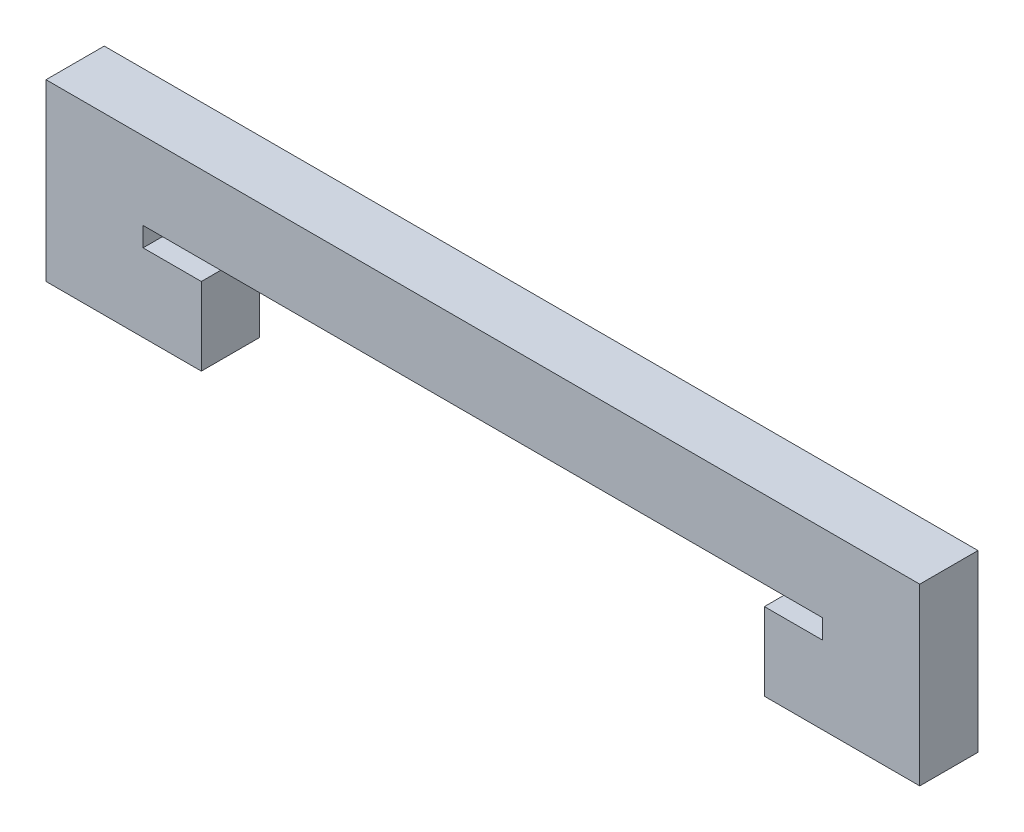
ISO-10303-21;
HEADER;
FILE_DESCRIPTION(('STEP AP214'),'2;1');
FILE_NAME('part.step','',(''),(''),'','','');
FILE_SCHEMA(('AUTOMOTIVE_DESIGN { 1 0 10303 214 1 1 1 1 }'));
ENDSEC;
DATA;
#1=APPLICATION_CONTEXT('core data for automotive mechanical design processes');
#2=APPLICATION_PROTOCOL_DEFINITION('international standard','automotive_design',2000,#1);
#3=PRODUCT_CONTEXT('',#1,'mechanical');
#4=PRODUCT('Part','Part','',(#3));
#5=PRODUCT_RELATED_PRODUCT_CATEGORY('part','',(#4));
#6=PRODUCT_DEFINITION_FORMATION('','',#4);
#7=PRODUCT_DEFINITION_CONTEXT('part definition',#1,'design');
#8=PRODUCT_DEFINITION('design','',#6,#7);
#9=PRODUCT_DEFINITION_SHAPE('','',#8);
#10=(LENGTH_UNIT() NAMED_UNIT(*) SI_UNIT(.MILLI.,.METRE.));
#11=(NAMED_UNIT(*) PLANE_ANGLE_UNIT() SI_UNIT($,.RADIAN.));
#12=(NAMED_UNIT(*) SI_UNIT($,.STERADIAN.) SOLID_ANGLE_UNIT());
#13=UNCERTAINTY_MEASURE_WITH_UNIT(LENGTH_MEASURE(1.E-05),#10,'distance_accuracy_value','');
#14=(GEOMETRIC_REPRESENTATION_CONTEXT(3) GLOBAL_UNCERTAINTY_ASSIGNED_CONTEXT((#13)) GLOBAL_UNIT_ASSIGNED_CONTEXT((#10,
#11,#12)) REPRESENTATION_CONTEXT('',''));
#15=CARTESIAN_POINT('',(0.,0.,0.));
#16=DIRECTION('',(0.,0.,1.));
#17=DIRECTION('',(1.,0.,0.));
#18=AXIS2_PLACEMENT_3D('',#15,#16,#17);
#19=CARTESIAN_POINT('',(17.5,0.,3.));
#20=DIRECTION('',(0.,1.,0.));
#21=DIRECTION('',(-1.,0.,0.));
#22=AXIS2_PLACEMENT_3D('',#19,#20,#21);
#23=PLANE('',#22);
#24=DIRECTION('',(1.,0.,0.));
#25=VECTOR('',#24,1.);
#26=CARTESIAN_POINT('',(17.5,0.,0.));
#27=LINE('',#26,#25);
#28=CARTESIAN_POINT('',(-17.5,0.,0.));
#29=VERTEX_POINT('',#28);
#30=CARTESIAN_POINT('',(17.5,0.,0.));
#31=VERTEX_POINT('',#30);
#32=EDGE_CURVE('E168',#29,#31,#27,.T.);
#33=ORIENTED_EDGE('',*,*,#32,.T.);
#34=DIRECTION('',(0.,0.,-1.));
#35=VECTOR('',#34,1.);
#36=CARTESIAN_POINT('',(17.5,0.,3.));
#37=LINE('',#36,#35);
#38=CARTESIAN_POINT('',(17.5,0.,3.));
#39=VERTEX_POINT('',#38);
#40=EDGE_CURVE('E11',#39,#31,#37,.T.);
#41=ORIENTED_EDGE('',*,*,#40,.F.);
#42=DIRECTION('',(1.,0.,0.));
#43=VECTOR('',#42,1.);
#44=CARTESIAN_POINT('',(17.5,0.,3.));
#45=LINE('',#44,#43);
#46=CARTESIAN_POINT('',(-17.5,0.,3.));
#47=VERTEX_POINT('',#46);
#48=EDGE_CURVE('E203',#47,#39,#45,.T.);
#49=ORIENTED_EDGE('',*,*,#48,.F.);
#50=DIRECTION('',(0.,0.,-1.));
#51=VECTOR('',#50,1.);
#52=CARTESIAN_POINT('',(-17.5,0.,3.));
#53=LINE('',#52,#51);
#54=EDGE_CURVE('E164',#47,#29,#53,.T.);
#55=ORIENTED_EDGE('',*,*,#54,.T.);
#56=EDGE_LOOP('',(#33,#41,#49,#55));
#57=FACE_BOUND('',#56,.T.);
#58=ADVANCED_FACE('F43',(#57),#23,.F.);
#59=CARTESIAN_POINT('',(17.5,-1.,3.));
#60=DIRECTION('',(1.,0.,0.));
#61=DIRECTION('',(0.,0.,-1.));
#62=AXIS2_PLACEMENT_3D('',#59,#60,#61);
#63=PLANE('',#62);
#64=DIRECTION('',(0.,-1.,0.));
#65=VECTOR('',#64,1.);
#66=CARTESIAN_POINT('',(17.5,-1.,0.));
#67=LINE('',#66,#65);
#68=CARTESIAN_POINT('',(17.5,-1.,0.));
#69=VERTEX_POINT('',#68);
#70=EDGE_CURVE('E172',#31,#69,#67,.T.);
#71=ORIENTED_EDGE('',*,*,#70,.T.);
#72=DIRECTION('',(0.,0.,-1.));
#73=VECTOR('',#72,1.);
#74=CARTESIAN_POINT('',(17.5,-1.,3.));
#75=LINE('',#74,#73);
#76=CARTESIAN_POINT('',(17.5,-1.,3.));
#77=VERTEX_POINT('',#76);
#78=EDGE_CURVE('E52',#77,#69,#75,.T.);
#79=ORIENTED_EDGE('',*,*,#78,.F.);
#80=DIRECTION('',(0.,-1.,0.));
#81=VECTOR('',#80,1.);
#82=CARTESIAN_POINT('',(17.5,-1.,3.));
#83=LINE('',#82,#81);
#84=EDGE_CURVE('E115',#39,#77,#83,.T.);
#85=ORIENTED_EDGE('',*,*,#84,.F.);
#86=ORIENTED_EDGE('',*,*,#40,.T.);
#87=EDGE_LOOP('',(#71,#79,#85,#86));
#88=FACE_BOUND('',#87,.T.);
#89=ADVANCED_FACE('F296',(#88),#63,.F.);
#90=CARTESIAN_POINT('',(14.5,-1.,3.));
#91=DIRECTION('',(0.,-1.,0.));
#92=DIRECTION('',(0.,0.,-1.));
#93=AXIS2_PLACEMENT_3D('',#90,#91,#92);
#94=PLANE('',#93);
#95=DIRECTION('',(-1.,0.,0.));
#96=VECTOR('',#95,1.);
#97=CARTESIAN_POINT('',(14.5,-1.,0.));
#98=LINE('',#97,#96);
#99=CARTESIAN_POINT('',(14.5,-1.,0.));
#100=VERTEX_POINT('',#99);
#101=EDGE_CURVE('E175',#69,#100,#98,.T.);
#102=ORIENTED_EDGE('',*,*,#101,.T.);
#103=DIRECTION('',(0.,0.,-1.));
#104=VECTOR('',#103,1.);
#105=CARTESIAN_POINT('',(14.5,-1.,3.));
#106=LINE('',#105,#104);
#107=CARTESIAN_POINT('',(14.5,-1.,3.));
#108=VERTEX_POINT('',#107);
#109=EDGE_CURVE('E230',#108,#100,#106,.T.);
#110=ORIENTED_EDGE('',*,*,#109,.F.);
#111=DIRECTION('',(-1.,0.,0.));
#112=VECTOR('',#111,1.);
#113=CARTESIAN_POINT('',(14.5,-1.,3.));
#114=LINE('',#113,#112);
#115=EDGE_CURVE('E240',#77,#108,#114,.T.);
#116=ORIENTED_EDGE('',*,*,#115,.F.);
#117=ORIENTED_EDGE('',*,*,#78,.T.);
#118=EDGE_LOOP('',(#102,#110,#116,#117));
#119=FACE_BOUND('',#118,.T.);
#120=ADVANCED_FACE('F238',(#119),#94,.F.);
#121=CARTESIAN_POINT('',(14.5,-5.,3.));
#122=DIRECTION('',(1.,0.,0.));
#123=DIRECTION('',(0.,0.,-1.));
#124=AXIS2_PLACEMENT_3D('',#121,#122,#123);
#125=PLANE('',#124);
#126=DIRECTION('',(0.,-1.,0.));
#127=VECTOR('',#126,1.);
#128=CARTESIAN_POINT('',(14.5,-5.,0.));
#129=LINE('',#128,#127);
#130=CARTESIAN_POINT('',(14.5,-5.,0.));
#131=VERTEX_POINT('',#130);
#132=EDGE_CURVE('E178',#100,#131,#129,.T.);
#133=ORIENTED_EDGE('',*,*,#132,.T.);
#134=DIRECTION('',(0.,0.,-1.));
#135=VECTOR('',#134,1.);
#136=CARTESIAN_POINT('',(14.5,-5.,3.));
#137=LINE('',#136,#135);
#138=CARTESIAN_POINT('',(14.5,-5.,3.));
#139=VERTEX_POINT('',#138);
#140=EDGE_CURVE('E226',#139,#131,#137,.T.);
#141=ORIENTED_EDGE('',*,*,#140,.F.);
#142=DIRECTION('',(0.,-1.,0.));
#143=VECTOR('',#142,1.);
#144=CARTESIAN_POINT('',(14.5,-5.,3.));
#145=LINE('',#144,#143);
#146=EDGE_CURVE('E259',#108,#139,#145,.T.);
#147=ORIENTED_EDGE('',*,*,#146,.F.);
#148=ORIENTED_EDGE('',*,*,#109,.T.);
#149=EDGE_LOOP('',(#133,#141,#147,#148));
#150=FACE_BOUND('',#149,.T.);
#151=ADVANCED_FACE('F249',(#150),#125,.F.);
#152=CARTESIAN_POINT('',(22.5,-5.,3.));
#153=DIRECTION('',(0.,1.,0.));
#154=DIRECTION('',(-1.,0.,0.));
#155=AXIS2_PLACEMENT_3D('',#152,#153,#154);
#156=PLANE('',#155);
#157=DIRECTION('',(1.,0.,0.));
#158=VECTOR('',#157,1.);
#159=CARTESIAN_POINT('',(22.5,-5.,0.));
#160=LINE('',#159,#158);
#161=CARTESIAN_POINT('',(22.5,-5.,0.));
#162=VERTEX_POINT('',#161);
#163=EDGE_CURVE('E181',#131,#162,#160,.T.);
#164=ORIENTED_EDGE('',*,*,#163,.T.);
#165=DIRECTION('',(0.,0.,-1.));
#166=VECTOR('',#165,1.);
#167=CARTESIAN_POINT('',(22.5,-5.,3.));
#168=LINE('',#167,#166);
#169=CARTESIAN_POINT('',(22.5,-5.,3.));
#170=VERTEX_POINT('',#169);
#171=EDGE_CURVE('E222',#170,#162,#168,.T.);
#172=ORIENTED_EDGE('',*,*,#171,.F.);
#173=DIRECTION('',(1.,0.,0.));
#174=VECTOR('',#173,1.);
#175=CARTESIAN_POINT('',(22.5,-5.,3.));
#176=LINE('',#175,#174);
#177=EDGE_CURVE('E255',#139,#170,#176,.T.);
#178=ORIENTED_EDGE('',*,*,#177,.F.);
#179=ORIENTED_EDGE('',*,*,#140,.T.);
#180=EDGE_LOOP('',(#164,#172,#178,#179));
#181=FACE_BOUND('',#180,.T.);
#182=ADVANCED_FACE('F253',(#181),#156,.F.);
#183=CARTESIAN_POINT('',(22.5,4.,3.));
#184=DIRECTION('',(-1.,0.,0.));
#185=DIRECTION('',(0.,0.,1.));
#186=AXIS2_PLACEMENT_3D('',#183,#184,#185);
#187=PLANE('',#186);
#188=DIRECTION('',(0.,1.,0.));
#189=VECTOR('',#188,1.);
#190=CARTESIAN_POINT('',(22.5,4.,0.));
#191=LINE('',#190,#189);
#192=CARTESIAN_POINT('',(22.5,4.,0.));
#193=VERTEX_POINT('',#192);
#194=EDGE_CURVE('E184',#162,#193,#191,.T.);
#195=ORIENTED_EDGE('',*,*,#194,.T.);
#196=DIRECTION('',(0.,0.,-1.));
#197=VECTOR('',#196,1.);
#198=CARTESIAN_POINT('',(22.5,4.,3.));
#199=LINE('',#198,#197);
#200=CARTESIAN_POINT('',(22.5,4.,3.));
#201=VERTEX_POINT('',#200);
#202=EDGE_CURVE('E218',#201,#193,#199,.T.);
#203=ORIENTED_EDGE('',*,*,#202,.F.);
#204=DIRECTION('',(0.,1.,0.));
#205=VECTOR('',#204,1.);
#206=CARTESIAN_POINT('',(22.5,4.,3.));
#207=LINE('',#206,#205);
#208=EDGE_CURVE('E258',#170,#201,#207,.T.);
#209=ORIENTED_EDGE('',*,*,#208,.F.);
#210=ORIENTED_EDGE('',*,*,#171,.T.);
#211=EDGE_LOOP('',(#195,#203,#209,#210));
#212=FACE_BOUND('',#211,.T.);
#213=ADVANCED_FACE('F309',(#212),#187,.F.);
#214=CARTESIAN_POINT('',(-22.5,4.,3.));
#215=DIRECTION('',(0.,-1.,0.));
#216=DIRECTION('',(1.,0.,0.));
#217=AXIS2_PLACEMENT_3D('',#214,#215,#216);
#218=PLANE('',#217);
#219=DIRECTION('',(-1.,0.,0.));
#220=VECTOR('',#219,1.);
#221=CARTESIAN_POINT('',(-22.5,4.,0.));
#222=LINE('',#221,#220);
#223=CARTESIAN_POINT('',(-22.5,4.,0.));
#224=VERTEX_POINT('',#223);
#225=EDGE_CURVE('E187',#193,#224,#222,.T.);
#226=ORIENTED_EDGE('',*,*,#225,.T.);
#227=DIRECTION('',(0.,0.,-1.));
#228=VECTOR('',#227,1.);
#229=CARTESIAN_POINT('',(-22.5,4.,3.));
#230=LINE('',#229,#228);
#231=CARTESIAN_POINT('',(-22.5,4.,3.));
#232=VERTEX_POINT('',#231);
#233=EDGE_CURVE('E214',#232,#224,#230,.T.);
#234=ORIENTED_EDGE('',*,*,#233,.F.);
#235=DIRECTION('',(-1.,0.,0.));
#236=VECTOR('',#235,1.);
#237=CARTESIAN_POINT('',(-22.5,4.,3.));
#238=LINE('',#237,#236);
#239=EDGE_CURVE('E263',#201,#232,#238,.T.);
#240=ORIENTED_EDGE('',*,*,#239,.F.);
#241=ORIENTED_EDGE('',*,*,#202,.T.);
#242=EDGE_LOOP('',(#226,#234,#240,#241));
#243=FACE_BOUND('',#242,.T.);
#244=ADVANCED_FACE('F312',(#243),#218,.F.);
#245=CARTESIAN_POINT('',(-22.5,-5.,3.));
#246=DIRECTION('',(1.,0.,0.));
#247=DIRECTION('',(0.,0.,-1.));
#248=AXIS2_PLACEMENT_3D('',#245,#246,#247);
#249=PLANE('',#248);
#250=DIRECTION('',(0.,-1.,0.));
#251=VECTOR('',#250,1.);
#252=CARTESIAN_POINT('',(-22.5,-5.,0.));
#253=LINE('',#252,#251);
#254=CARTESIAN_POINT('',(-22.5,-5.,0.));
#255=VERTEX_POINT('',#254);
#256=EDGE_CURVE('E191',#224,#255,#253,.T.);
#257=ORIENTED_EDGE('',*,*,#256,.T.);
#258=DIRECTION('',(0.,0.,-1.));
#259=VECTOR('',#258,1.);
#260=CARTESIAN_POINT('',(-22.5,-5.,3.));
#261=LINE('',#260,#259);
#262=CARTESIAN_POINT('',(-22.5,-5.,3.));
#263=VERTEX_POINT('',#262);
#264=EDGE_CURVE('E210',#263,#255,#261,.T.);
#265=ORIENTED_EDGE('',*,*,#264,.F.);
#266=DIRECTION('',(0.,-1.,0.));
#267=VECTOR('',#266,1.);
#268=CARTESIAN_POINT('',(-22.5,0.,3.));
#269=LINE('',#268,#267);
#270=EDGE_CURVE('E270',#232,#263,#269,.T.);
#271=ORIENTED_EDGE('',*,*,#270,.F.);
#272=ORIENTED_EDGE('',*,*,#233,.T.);
#273=EDGE_LOOP('',(#257,#265,#271,#272));
#274=FACE_BOUND('',#273,.T.);
#275=ADVANCED_FACE('F278',(#274),#249,.F.);
#276=CARTESIAN_POINT('',(-14.5,-5.,3.));
#277=DIRECTION('',(0.,1.,0.));
#278=DIRECTION('',(0.,0.,1.));
#279=AXIS2_PLACEMENT_3D('',#276,#277,#278);
#280=PLANE('',#279);
#281=DIRECTION('',(1.,0.,0.));
#282=VECTOR('',#281,1.);
#283=CARTESIAN_POINT('',(-14.5,-5.,0.));
#284=LINE('',#283,#282);
#285=CARTESIAN_POINT('',(-14.5,-5.,0.));
#286=VERTEX_POINT('',#285);
#287=EDGE_CURVE('E194',#255,#286,#284,.T.);
#288=ORIENTED_EDGE('',*,*,#287,.T.);
#289=DIRECTION('',(0.,0.,-1.));
#290=VECTOR('',#289,1.);
#291=CARTESIAN_POINT('',(-14.5,-5.,3.));
#292=LINE('',#291,#290);
#293=CARTESIAN_POINT('',(-14.5,-5.,3.));
#294=VERTEX_POINT('',#293);
#295=EDGE_CURVE('E157',#294,#286,#292,.T.);
#296=ORIENTED_EDGE('',*,*,#295,.F.);
#297=DIRECTION('',(1.,0.,0.));
#298=VECTOR('',#297,1.);
#299=CARTESIAN_POINT('',(-14.5,-5.,3.));
#300=LINE('',#299,#298);
#301=EDGE_CURVE('E146',#263,#294,#300,.T.);
#302=ORIENTED_EDGE('',*,*,#301,.F.);
#303=ORIENTED_EDGE('',*,*,#264,.T.);
#304=EDGE_LOOP('',(#288,#296,#302,#303));
#305=FACE_BOUND('',#304,.T.);
#306=ADVANCED_FACE('F281',(#305),#280,.F.);
#307=CARTESIAN_POINT('',(-14.5,-1.,3.));
#308=DIRECTION('',(-1.,0.,0.));
#309=DIRECTION('',(0.,0.,1.));
#310=AXIS2_PLACEMENT_3D('',#307,#308,#309);
#311=PLANE('',#310);
#312=DIRECTION('',(0.,1.,0.));
#313=VECTOR('',#312,1.);
#314=CARTESIAN_POINT('',(-14.5,-1.,0.));
#315=LINE('',#314,#313);
#316=CARTESIAN_POINT('',(-14.5,-1.,0.));
#317=VERTEX_POINT('',#316);
#318=EDGE_CURVE('E155',#286,#317,#315,.T.);
#319=ORIENTED_EDGE('',*,*,#318,.T.);
#320=DIRECTION('',(0.,0.,-1.));
#321=VECTOR('',#320,1.);
#322=CARTESIAN_POINT('',(-14.5,-1.,3.));
#323=LINE('',#322,#321);
#324=CARTESIAN_POINT('',(-14.5,-1.,3.));
#325=VERTEX_POINT('',#324);
#326=EDGE_CURVE('E152',#325,#317,#323,.T.);
#327=ORIENTED_EDGE('',*,*,#326,.F.);
#328=DIRECTION('',(0.,1.,0.));
#329=VECTOR('',#328,1.);
#330=CARTESIAN_POINT('',(-14.5,-1.,3.));
#331=LINE('',#330,#329);
#332=EDGE_CURVE('E140',#294,#325,#331,.T.);
#333=ORIENTED_EDGE('',*,*,#332,.F.);
#334=ORIENTED_EDGE('',*,*,#295,.T.);
#335=EDGE_LOOP('',(#319,#327,#333,#334));
#336=FACE_BOUND('',#335,.T.);
#337=ADVANCED_FACE('F153',(#336),#311,.F.);
#338=CARTESIAN_POINT('',(-17.5,-1.,3.));
#339=DIRECTION('',(0.,-1.,0.));
#340=DIRECTION('',(0.,0.,-1.));
#341=AXIS2_PLACEMENT_3D('',#338,#339,#340);
#342=PLANE('',#341);
#343=DIRECTION('',(-1.,0.,0.));
#344=VECTOR('',#343,1.);
#345=CARTESIAN_POINT('',(-17.5,-1.,0.));
#346=LINE('',#345,#344);
#347=CARTESIAN_POINT('',(-17.5,-1.,0.));
#348=VERTEX_POINT('',#347);
#349=EDGE_CURVE('E101',#317,#348,#346,.T.);
#350=ORIENTED_EDGE('',*,*,#349,.T.);
#351=DIRECTION('',(0.,0.,-1.));
#352=VECTOR('',#351,1.);
#353=CARTESIAN_POINT('',(-17.5,-1.,3.));
#354=LINE('',#353,#352);
#355=CARTESIAN_POINT('',(-17.5,-1.,3.));
#356=VERTEX_POINT('',#355);
#357=EDGE_CURVE('E158',#356,#348,#354,.T.);
#358=ORIENTED_EDGE('',*,*,#357,.F.);
#359=DIRECTION('',(-1.,0.,0.));
#360=VECTOR('',#359,1.);
#361=CARTESIAN_POINT('',(-17.5,-1.,3.));
#362=LINE('',#361,#360);
#363=EDGE_CURVE('E144',#325,#356,#362,.T.);
#364=ORIENTED_EDGE('',*,*,#363,.F.);
#365=ORIENTED_EDGE('',*,*,#326,.T.);
#366=EDGE_LOOP('',(#350,#358,#364,#365));
#367=FACE_BOUND('',#366,.T.);
#368=ADVANCED_FACE('F160',(#367),#342,.F.);
#369=CARTESIAN_POINT('',(-17.5,0.,3.));
#370=DIRECTION('',(-1.,0.,0.));
#371=DIRECTION('',(0.,0.,1.));
#372=AXIS2_PLACEMENT_3D('',#369,#370,#371);
#373=PLANE('',#372);
#374=DIRECTION('',(0.,1.,0.));
#375=VECTOR('',#374,1.);
#376=CARTESIAN_POINT('',(-17.5,0.,0.));
#377=LINE('',#376,#375);
#378=EDGE_CURVE('E107',#348,#29,#377,.T.);
#379=ORIENTED_EDGE('',*,*,#378,.T.);
#380=ORIENTED_EDGE('',*,*,#54,.F.);
#381=DIRECTION('',(0.,1.,0.));
#382=VECTOR('',#381,1.);
#383=CARTESIAN_POINT('',(-17.5,0.,3.));
#384=LINE('',#383,#382);
#385=EDGE_CURVE('E60',#356,#47,#384,.T.);
#386=ORIENTED_EDGE('',*,*,#385,.F.);
#387=ORIENTED_EDGE('',*,*,#357,.T.);
#388=EDGE_LOOP('',(#379,#380,#386,#387));
#389=FACE_BOUND('',#388,.T.);
#390=ADVANCED_FACE('F285',(#389),#373,.F.);
#391=CARTESIAN_POINT('',(0.,0.,3.));
#392=DIRECTION('',(0.,0.,1.));
#393=DIRECTION('',(1.,0.,0.));
#394=AXIS2_PLACEMENT_3D('',#391,#392,#393);
#395=PLANE('',#394);
#396=ORIENTED_EDGE('',*,*,#48,.T.);
#397=ORIENTED_EDGE('',*,*,#84,.T.);
#398=ORIENTED_EDGE('',*,*,#115,.T.);
#399=ORIENTED_EDGE('',*,*,#146,.T.);
#400=ORIENTED_EDGE('',*,*,#177,.T.);
#401=ORIENTED_EDGE('',*,*,#208,.T.);
#402=ORIENTED_EDGE('',*,*,#239,.T.);
#403=ORIENTED_EDGE('',*,*,#270,.T.);
#404=ORIENTED_EDGE('',*,*,#301,.T.);
#405=ORIENTED_EDGE('',*,*,#332,.T.);
#406=ORIENTED_EDGE('',*,*,#363,.T.);
#407=ORIENTED_EDGE('',*,*,#385,.T.);
#408=EDGE_LOOP('',(#396,#397,#398,#399,#400,#401,#402,#403,#404,#405,#406,#407));
#409=FACE_BOUND('',#408,.T.);
#410=ADVANCED_FACE('F142',(#409),#395,.T.);
#411=CARTESIAN_POINT('',(0.,0.,0.));
#412=DIRECTION('',(0.,0.,1.));
#413=DIRECTION('',(1.,0.,0.));
#414=AXIS2_PLACEMENT_3D('',#411,#412,#413);
#415=PLANE('',#414);
#416=ORIENTED_EDGE('',*,*,#32,.F.);
#417=ORIENTED_EDGE('',*,*,#378,.F.);
#418=ORIENTED_EDGE('',*,*,#349,.F.);
#419=ORIENTED_EDGE('',*,*,#318,.F.);
#420=ORIENTED_EDGE('',*,*,#287,.F.);
#421=ORIENTED_EDGE('',*,*,#256,.F.);
#422=ORIENTED_EDGE('',*,*,#225,.F.);
#423=ORIENTED_EDGE('',*,*,#194,.F.);
#424=ORIENTED_EDGE('',*,*,#163,.F.);
#425=ORIENTED_EDGE('',*,*,#132,.F.);
#426=ORIENTED_EDGE('',*,*,#101,.F.);
#427=ORIENTED_EDGE('',*,*,#70,.F.);
#428=EDGE_LOOP('',(#416,#417,#418,#419,#420,#421,#422,#423,#424,#425,#426,#427));
#429=FACE_BOUND('',#428,.T.);
#430=ADVANCED_FACE('F244',(#429),#415,.F.);
#431=CLOSED_SHELL('',(#58,#89,#120,#151,#182,#213,#244,#275,#306,#337,#368,#390,#410,#430));
#432=MANIFOLD_SOLID_BREP('B2',#431);
#433=ADVANCED_BREP_SHAPE_REPRESENTATION('',(#18,#432),#14);
#434=SHAPE_DEFINITION_REPRESENTATION(#9,#433);
ENDSEC;
END-ISO-10303-21;
